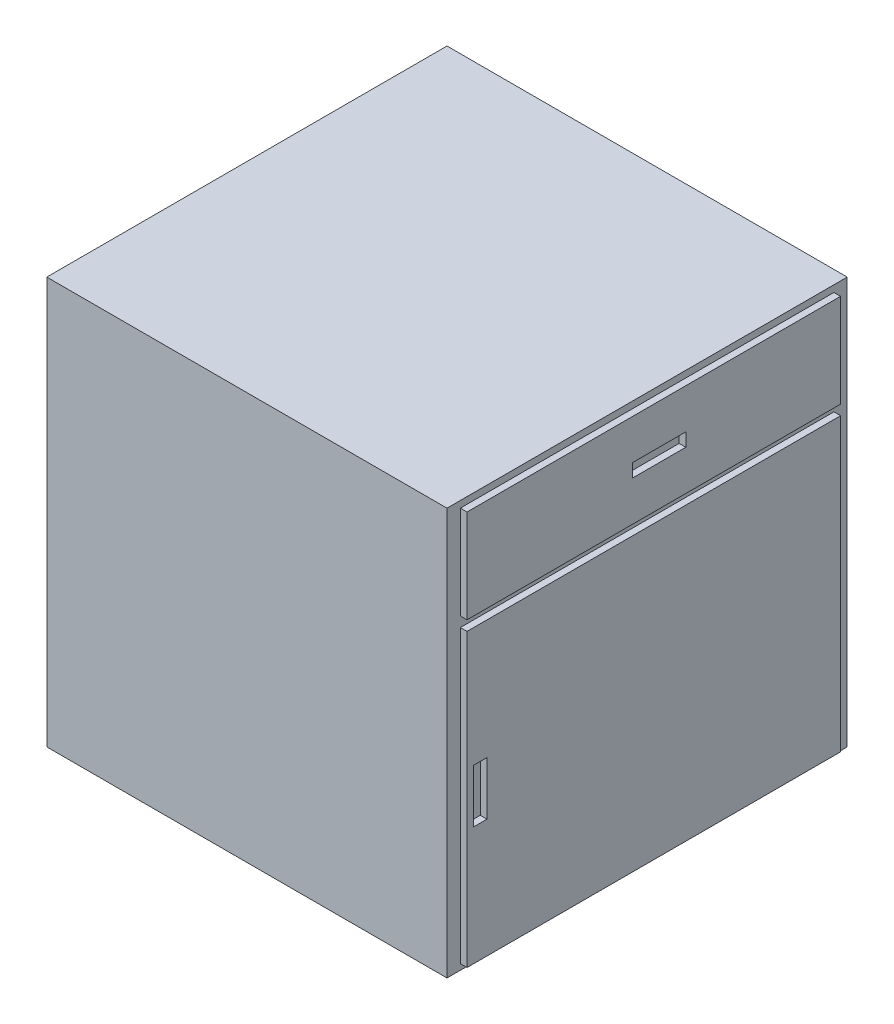
ISO-10303-21;
HEADER;
FILE_DESCRIPTION(('STEP AP214'),'2;1');
FILE_NAME('part.step','',(''),(''),'','','');
FILE_SCHEMA(('AUTOMOTIVE_DESIGN { 1 0 10303 214 1 1 1 1 }'));
ENDSEC;
DATA;
#1=APPLICATION_CONTEXT('core data for automotive mechanical design processes');
#2=APPLICATION_PROTOCOL_DEFINITION('international standard','automotive_design',2000,#1);
#3=PRODUCT_CONTEXT('',#1,'mechanical');
#4=PRODUCT('Part','Part','',(#3));
#5=PRODUCT_RELATED_PRODUCT_CATEGORY('part','',(#4));
#6=PRODUCT_DEFINITION_FORMATION('','',#4);
#7=PRODUCT_DEFINITION_CONTEXT('part definition',#1,'design');
#8=PRODUCT_DEFINITION('design','',#6,#7);
#9=PRODUCT_DEFINITION_SHAPE('','',#8);
#10=(LENGTH_UNIT() NAMED_UNIT(*) SI_UNIT(.MILLI.,.METRE.));
#11=(NAMED_UNIT(*) PLANE_ANGLE_UNIT() SI_UNIT($,.RADIAN.));
#12=(NAMED_UNIT(*) SI_UNIT($,.STERADIAN.) SOLID_ANGLE_UNIT());
#13=UNCERTAINTY_MEASURE_WITH_UNIT(LENGTH_MEASURE(1.E-05),#10,'distance_accuracy_value','');
#14=(GEOMETRIC_REPRESENTATION_CONTEXT(3) GLOBAL_UNCERTAINTY_ASSIGNED_CONTEXT((#13)) GLOBAL_UNIT_ASSIGNED_CONTEXT((#10,
#11,#12)) REPRESENTATION_CONTEXT('',''));
#15=CARTESIAN_POINT('',(0.,0.,0.));
#16=DIRECTION('',(0.,0.,1.));
#17=DIRECTION('',(1.,0.,0.));
#18=AXIS2_PLACEMENT_3D('',#15,#16,#17);
#19=CARTESIAN_POINT('',(0.,0.,600.));
#20=DIRECTION('',(-1.,0.,0.));
#21=DIRECTION('',(0.,-1.,0.));
#22=AXIS2_PLACEMENT_3D('',#19,#20,#21);
#23=PLANE('',#22);
#24=DIRECTION('',(0.,1.,0.));
#25=VECTOR('',#24,1.);
#26=CARTESIAN_POINT('',(0.,0.,0.));
#27=LINE('',#26,#25);
#28=CARTESIAN_POINT('',(0.,-610.,0.));
#29=VERTEX_POINT('',#28);
#30=CARTESIAN_POINT('',(0.,0.,0.));
#31=VERTEX_POINT('',#30);
#32=EDGE_CURVE('E302',#29,#31,#27,.T.);
#33=ORIENTED_EDGE('',*,*,#32,.T.);
#34=DIRECTION('',(0.,0.,-1.));
#35=VECTOR('',#34,1.);
#36=CARTESIAN_POINT('',(0.,0.,600.));
#37=LINE('',#36,#35);
#38=CARTESIAN_POINT('',(0.,0.,600.));
#39=VERTEX_POINT('',#38);
#40=EDGE_CURVE('E11',#39,#31,#37,.T.);
#41=ORIENTED_EDGE('',*,*,#40,.F.);
#42=DIRECTION('',(0.,1.,0.));
#43=VECTOR('',#42,1.);
#44=CARTESIAN_POINT('',(0.,0.,600.));
#45=LINE('',#44,#43);
#46=CARTESIAN_POINT('',(0.,-610.,600.));
#47=VERTEX_POINT('',#46);
#48=EDGE_CURVE('E303',#47,#39,#45,.T.);
#49=ORIENTED_EDGE('',*,*,#48,.F.);
#50=DIRECTION('',(0.,0.,-1.));
#51=VECTOR('',#50,1.);
#52=CARTESIAN_POINT('',(0.,-610.,600.));
#53=LINE('',#52,#51);
#54=EDGE_CURVE('E313',#47,#29,#53,.T.);
#55=ORIENTED_EDGE('',*,*,#54,.T.);
#56=EDGE_LOOP('',(#33,#41,#49,#55));
#57=FACE_BOUND('',#56,.T.);
#58=DIRECTION('',(0.,-1.,0.));
#59=VECTOR('',#58,1.);
#60=CARTESIAN_POINT('',(0.,-9.99660470248492,580.));
#61=LINE('',#60,#59);
#62=CARTESIAN_POINT('',(0.,-9.99660470248492,580.));
#63=VERTEX_POINT('',#62);
#64=CARTESIAN_POINT('',(0.,-149.996604702485,580.));
#65=VERTEX_POINT('',#64);
#66=EDGE_CURVE('E269',#63,#65,#61,.T.);
#67=ORIENTED_EDGE('',*,*,#66,.F.);
#68=DIRECTION('',(0.,0.,1.));
#69=VECTOR('',#68,1.);
#70=CARTESIAN_POINT('',(0.,-9.99660470248492,580.));
#71=LINE('',#70,#69);
#72=CARTESIAN_POINT('',(0.,-9.99660470248492,20.));
#73=VERTEX_POINT('',#72);
#74=EDGE_CURVE('E274',#73,#63,#71,.T.);
#75=ORIENTED_EDGE('',*,*,#74,.F.);
#76=DIRECTION('',(0.,1.,0.));
#77=VECTOR('',#76,1.);
#78=CARTESIAN_POINT('',(0.,-9.99660470248492,20.));
#79=LINE('',#78,#77);
#80=CARTESIAN_POINT('',(0.,-149.996604702485,20.));
#81=VERTEX_POINT('',#80);
#82=EDGE_CURVE('E286',#81,#73,#79,.T.);
#83=ORIENTED_EDGE('',*,*,#82,.F.);
#84=DIRECTION('',(0.,0.,-1.));
#85=VECTOR('',#84,1.);
#86=CARTESIAN_POINT('',(0.,-149.996604702485,580.));
#87=LINE('',#86,#85);
#88=EDGE_CURVE('E283',#65,#81,#87,.T.);
#89=ORIENTED_EDGE('',*,*,#88,.F.);
#90=EDGE_LOOP('',(#67,#75,#83,#89));
#91=FACE_BOUND('',#90,.T.);
#92=DIRECTION('',(0.,-1.,0.));
#93=VECTOR('',#92,1.);
#94=CARTESIAN_POINT('',(0.,-164.996604702485,580.));
#95=LINE('',#94,#93);
#96=CARTESIAN_POINT('',(0.,-164.996604702485,580.));
#97=VERTEX_POINT('',#96);
#98=CARTESIAN_POINT('',(0.,-601.436488002754,580.));
#99=VERTEX_POINT('',#98);
#100=EDGE_CURVE('E188',#97,#99,#95,.T.);
#101=ORIENTED_EDGE('',*,*,#100,.F.);
#102=DIRECTION('',(0.,0.,1.));
#103=VECTOR('',#102,1.);
#104=CARTESIAN_POINT('',(0.,-164.996604702485,580.));
#105=LINE('',#104,#103);
#106=CARTESIAN_POINT('',(0.,-164.996604702485,20.));
#107=VERTEX_POINT('',#106);
#108=EDGE_CURVE('E216',#107,#97,#105,.T.);
#109=ORIENTED_EDGE('',*,*,#108,.F.);
#110=DIRECTION('',(0.,1.,0.));
#111=VECTOR('',#110,1.);
#112=CARTESIAN_POINT('',(0.,-164.996604702485,20.));
#113=LINE('',#112,#111);
#114=CARTESIAN_POINT('',(0.,-601.436488002754,20.));
#115=VERTEX_POINT('',#114);
#116=EDGE_CURVE('E54',#115,#107,#113,.T.);
#117=ORIENTED_EDGE('',*,*,#116,.F.);
#118=DIRECTION('',(0.,0.,-1.));
#119=VECTOR('',#118,1.);
#120=CARTESIAN_POINT('',(0.,-601.436488002754,580.));
#121=LINE('',#120,#119);
#122=EDGE_CURVE('E49',#99,#115,#121,.T.);
#123=ORIENTED_EDGE('',*,*,#122,.F.);
#124=EDGE_LOOP('',(#101,#109,#117,#123));
#125=FACE_BOUND('',#124,.T.);
#126=ADVANCED_FACE('F34',(#57,#91,#125),#23,.F.);
#127=CARTESIAN_POINT('',(0.,0.,600.));
#128=DIRECTION('',(0.,-1.,0.));
#129=DIRECTION('',(1.,0.,0.));
#130=AXIS2_PLACEMENT_3D('',#127,#128,#129);
#131=PLANE('',#130);
#132=DIRECTION('',(-1.,0.,0.));
#133=VECTOR('',#132,1.);
#134=CARTESIAN_POINT('',(0.,0.,0.));
#135=LINE('',#134,#133);
#136=CARTESIAN_POINT('',(-600.,0.,0.));
#137=VERTEX_POINT('',#136);
#138=EDGE_CURVE('E316',#31,#137,#135,.T.);
#139=ORIENTED_EDGE('',*,*,#138,.T.);
#140=DIRECTION('',(0.,0.,-1.));
#141=VECTOR('',#140,1.);
#142=CARTESIAN_POINT('',(-600.,0.,600.));
#143=LINE('',#142,#141);
#144=CARTESIAN_POINT('',(-600.,0.,600.));
#145=VERTEX_POINT('',#144);
#146=EDGE_CURVE('E42',#145,#137,#143,.T.);
#147=ORIENTED_EDGE('',*,*,#146,.F.);
#148=DIRECTION('',(-1.,0.,0.));
#149=VECTOR('',#148,1.);
#150=CARTESIAN_POINT('',(0.,0.,600.));
#151=LINE('',#150,#149);
#152=EDGE_CURVE('E306',#39,#145,#151,.T.);
#153=ORIENTED_EDGE('',*,*,#152,.F.);
#154=ORIENTED_EDGE('',*,*,#40,.T.);
#155=EDGE_LOOP('',(#139,#147,#153,#154));
#156=FACE_BOUND('',#155,.T.);
#157=ADVANCED_FACE('F347',(#156),#131,.F.);
#158=CARTESIAN_POINT('',(-600.,0.,600.));
#159=DIRECTION('',(1.,0.,0.));
#160=DIRECTION('',(0.,0.,-1.));
#161=AXIS2_PLACEMENT_3D('',#158,#159,#160);
#162=PLANE('',#161);
#163=DIRECTION('',(0.,-1.,0.));
#164=VECTOR('',#163,1.);
#165=CARTESIAN_POINT('',(-600.,0.,0.));
#166=LINE('',#165,#164);
#167=CARTESIAN_POINT('',(-600.,-610.,0.));
#168=VERTEX_POINT('',#167);
#169=EDGE_CURVE('E318',#137,#168,#166,.T.);
#170=ORIENTED_EDGE('',*,*,#169,.T.);
#171=DIRECTION('',(0.,0.,-1.));
#172=VECTOR('',#171,1.);
#173=CARTESIAN_POINT('',(-600.,-610.,600.));
#174=LINE('',#173,#172);
#175=CARTESIAN_POINT('',(-600.,-610.,600.));
#176=VERTEX_POINT('',#175);
#177=EDGE_CURVE('E323',#176,#168,#174,.T.);
#178=ORIENTED_EDGE('',*,*,#177,.F.);
#179=DIRECTION('',(0.,-1.,0.));
#180=VECTOR('',#179,1.);
#181=CARTESIAN_POINT('',(-600.,0.,600.));
#182=LINE('',#181,#180);
#183=EDGE_CURVE('E309',#145,#176,#182,.T.);
#184=ORIENTED_EDGE('',*,*,#183,.F.);
#185=ORIENTED_EDGE('',*,*,#146,.T.);
#186=EDGE_LOOP('',(#170,#178,#184,#185));
#187=FACE_BOUND('',#186,.T.);
#188=ADVANCED_FACE('F330',(#187),#162,.F.);
#189=CARTESIAN_POINT('',(0.,-610.,600.));
#190=DIRECTION('',(0.,1.,0.));
#191=DIRECTION('',(-1.,0.,0.));
#192=AXIS2_PLACEMENT_3D('',#189,#190,#191);
#193=PLANE('',#192);
#194=DIRECTION('',(1.,0.,0.));
#195=VECTOR('',#194,1.);
#196=CARTESIAN_POINT('',(0.,-610.,0.));
#197=LINE('',#196,#195);
#198=EDGE_CURVE('E307',#168,#29,#197,.T.);
#199=ORIENTED_EDGE('',*,*,#198,.T.);
#200=ORIENTED_EDGE('',*,*,#54,.F.);
#201=DIRECTION('',(1.,0.,0.));
#202=VECTOR('',#201,1.);
#203=CARTESIAN_POINT('',(0.,-610.,600.));
#204=LINE('',#203,#202);
#205=EDGE_CURVE('E311',#176,#47,#204,.T.);
#206=ORIENTED_EDGE('',*,*,#205,.F.);
#207=ORIENTED_EDGE('',*,*,#177,.T.);
#208=EDGE_LOOP('',(#199,#200,#206,#207));
#209=FACE_BOUND('',#208,.T.);
#210=ADVANCED_FACE('F339',(#209),#193,.F.);
#211=CARTESIAN_POINT('',(0.,0.,600.));
#212=DIRECTION('',(0.,0.,-1.));
#213=DIRECTION('',(-1.,0.,0.));
#214=AXIS2_PLACEMENT_3D('',#211,#212,#213);
#215=PLANE('',#214);
#216=ORIENTED_EDGE('',*,*,#48,.T.);
#217=ORIENTED_EDGE('',*,*,#152,.T.);
#218=ORIENTED_EDGE('',*,*,#183,.T.);
#219=ORIENTED_EDGE('',*,*,#205,.T.);
#220=EDGE_LOOP('',(#216,#217,#218,#219));
#221=FACE_BOUND('',#220,.T.);
#222=ADVANCED_FACE('F346',(#221),#215,.F.);
#223=CARTESIAN_POINT('',(0.,0.,0.));
#224=DIRECTION('',(0.,0.,-1.));
#225=DIRECTION('',(-1.,0.,0.));
#226=AXIS2_PLACEMENT_3D('',#223,#224,#225);
#227=PLANE('',#226);
#228=ORIENTED_EDGE('',*,*,#32,.F.);
#229=ORIENTED_EDGE('',*,*,#198,.F.);
#230=ORIENTED_EDGE('',*,*,#169,.F.);
#231=ORIENTED_EDGE('',*,*,#138,.F.);
#232=EDGE_LOOP('',(#228,#229,#230,#231));
#233=FACE_BOUND('',#232,.T.);
#234=ADVANCED_FACE('F336',(#233),#227,.T.);
#235=CARTESIAN_POINT('',(10.,0.,0.));
#236=DIRECTION('',(1.,0.,0.));
#237=DIRECTION('',(0.,1.,0.));
#238=AXIS2_PLACEMENT_3D('',#235,#236,#237);
#239=PLANE('',#238);
#240=DIRECTION('',(0.,-1.,0.));
#241=VECTOR('',#240,1.);
#242=CARTESIAN_POINT('',(10.,-9.99660470248492,580.));
#243=LINE('',#242,#241);
#244=CARTESIAN_POINT('',(10.,-9.99660470248492,580.));
#245=VERTEX_POINT('',#244);
#246=CARTESIAN_POINT('',(10.,-149.996604702485,580.));
#247=VERTEX_POINT('',#246);
#248=EDGE_CURVE('E270',#245,#247,#243,.T.);
#249=ORIENTED_EDGE('',*,*,#248,.T.);
#250=DIRECTION('',(0.,0.,-1.));
#251=VECTOR('',#250,1.);
#252=CARTESIAN_POINT('',(10.,-149.996604702485,580.));
#253=LINE('',#252,#251);
#254=CARTESIAN_POINT('',(10.,-149.996604702485,20.));
#255=VERTEX_POINT('',#254);
#256=EDGE_CURVE('E273',#247,#255,#253,.T.);
#257=ORIENTED_EDGE('',*,*,#256,.T.);
#258=DIRECTION('',(0.,1.,0.));
#259=VECTOR('',#258,1.);
#260=CARTESIAN_POINT('',(10.,-9.99660470248492,20.));
#261=LINE('',#260,#259);
#262=CARTESIAN_POINT('',(10.,-9.99660470248492,20.));
#263=VERTEX_POINT('',#262);
#264=EDGE_CURVE('E276',#255,#263,#261,.T.);
#265=ORIENTED_EDGE('',*,*,#264,.T.);
#266=DIRECTION('',(0.,0.,1.));
#267=VECTOR('',#266,1.);
#268=CARTESIAN_POINT('',(10.,-9.99660470248492,580.));
#269=LINE('',#268,#267);
#270=EDGE_CURVE('E278',#263,#245,#269,.T.);
#271=ORIENTED_EDGE('',*,*,#270,.T.);
#272=EDGE_LOOP('',(#249,#257,#265,#271));
#273=FACE_BOUND('',#272,.T.);
#274=DIRECTION('',(0.,0.,-1.));
#275=VECTOR('',#274,1.);
#276=CARTESIAN_POINT('',(10.,-89.9605296664098,332.));
#277=LINE('',#276,#275);
#278=CARTESIAN_POINT('',(10.,-89.9605296664098,332.));
#279=VERTEX_POINT('',#278);
#280=CARTESIAN_POINT('',(10.,-89.9605296664098,252.));
#281=VERTEX_POINT('',#280);
#282=EDGE_CURVE('E242',#279,#281,#277,.T.);
#283=ORIENTED_EDGE('',*,*,#282,.F.);
#284=DIRECTION('',(0.,-1.,0.));
#285=VECTOR('',#284,1.);
#286=CARTESIAN_POINT('',(10.,-69.9605296664098,332.));
#287=LINE('',#286,#285);
#288=CARTESIAN_POINT('',(10.,-69.9605296664098,332.));
#289=VERTEX_POINT('',#288);
#290=EDGE_CURVE('E240',#289,#279,#287,.T.);
#291=ORIENTED_EDGE('',*,*,#290,.F.);
#292=DIRECTION('',(0.,0.,1.));
#293=VECTOR('',#292,1.);
#294=CARTESIAN_POINT('',(10.,-69.9605296664098,332.));
#295=LINE('',#294,#293);
#296=CARTESIAN_POINT('',(10.,-69.9605296664098,252.));
#297=VERTEX_POINT('',#296);
#298=EDGE_CURVE('E248',#297,#289,#295,.T.);
#299=ORIENTED_EDGE('',*,*,#298,.F.);
#300=DIRECTION('',(0.,1.,0.));
#301=VECTOR('',#300,1.);
#302=CARTESIAN_POINT('',(10.,-69.9605296664098,252.));
#303=LINE('',#302,#301);
#304=EDGE_CURVE('E245',#281,#297,#303,.T.);
#305=ORIENTED_EDGE('',*,*,#304,.F.);
#306=EDGE_LOOP('',(#283,#291,#299,#305));
#307=FACE_BOUND('',#306,.T.);
#308=ADVANCED_FACE('F360',(#273,#307),#239,.T.);
#309=CARTESIAN_POINT('',(10.,-9.99660470248492,580.));
#310=DIRECTION('',(0.,0.,-1.));
#311=DIRECTION('',(0.,1.,0.));
#312=AXIS2_PLACEMENT_3D('',#309,#310,#311);
#313=PLANE('',#312);
#314=ORIENTED_EDGE('',*,*,#66,.T.);
#315=DIRECTION('',(-1.,0.,0.));
#316=VECTOR('',#315,1.);
#317=CARTESIAN_POINT('',(10.,-149.996604702485,580.));
#318=LINE('',#317,#316);
#319=EDGE_CURVE('E299',#247,#65,#318,.T.);
#320=ORIENTED_EDGE('',*,*,#319,.F.);
#321=ORIENTED_EDGE('',*,*,#248,.F.);
#322=DIRECTION('',(-1.,0.,0.));
#323=VECTOR('',#322,1.);
#324=CARTESIAN_POINT('',(10.,-9.99660470248492,580.));
#325=LINE('',#324,#323);
#326=EDGE_CURVE('E280',#245,#63,#325,.T.);
#327=ORIENTED_EDGE('',*,*,#326,.T.);
#328=EDGE_LOOP('',(#314,#320,#321,#327));
#329=FACE_BOUND('',#328,.T.);
#330=ADVANCED_FACE('F363',(#329),#313,.F.);
#331=CARTESIAN_POINT('',(10.,-149.996604702485,580.));
#332=DIRECTION('',(0.,1.,0.));
#333=DIRECTION('',(-1.,0.,0.));
#334=AXIS2_PLACEMENT_3D('',#331,#332,#333);
#335=PLANE('',#334);
#336=ORIENTED_EDGE('',*,*,#88,.T.);
#337=DIRECTION('',(-1.,0.,0.));
#338=VECTOR('',#337,1.);
#339=CARTESIAN_POINT('',(10.,-149.996604702485,20.));
#340=LINE('',#339,#338);
#341=EDGE_CURVE('E296',#255,#81,#340,.T.);
#342=ORIENTED_EDGE('',*,*,#341,.F.);
#343=ORIENTED_EDGE('',*,*,#256,.F.);
#344=ORIENTED_EDGE('',*,*,#319,.T.);
#345=EDGE_LOOP('',(#336,#342,#343,#344));
#346=FACE_BOUND('',#345,.T.);
#347=ADVANCED_FACE('F366',(#346),#335,.F.);
#348=CARTESIAN_POINT('',(10.,-9.99660470248492,20.));
#349=DIRECTION('',(0.,0.,1.));
#350=DIRECTION('',(1.,0.,0.));
#351=AXIS2_PLACEMENT_3D('',#348,#349,#350);
#352=PLANE('',#351);
#353=ORIENTED_EDGE('',*,*,#82,.T.);
#354=DIRECTION('',(-1.,0.,0.));
#355=VECTOR('',#354,1.);
#356=CARTESIAN_POINT('',(10.,-9.99660470248492,20.));
#357=LINE('',#356,#355);
#358=EDGE_CURVE('E293',#263,#73,#357,.T.);
#359=ORIENTED_EDGE('',*,*,#358,.F.);
#360=ORIENTED_EDGE('',*,*,#264,.F.);
#361=ORIENTED_EDGE('',*,*,#341,.T.);
#362=EDGE_LOOP('',(#353,#359,#360,#361));
#363=FACE_BOUND('',#362,.T.);
#364=ADVANCED_FACE('F370',(#363),#352,.F.);
#365=CARTESIAN_POINT('',(10.,-9.99660470248492,580.));
#366=DIRECTION('',(0.,-1.,0.));
#367=DIRECTION('',(1.,0.,0.));
#368=AXIS2_PLACEMENT_3D('',#365,#366,#367);
#369=PLANE('',#368);
#370=ORIENTED_EDGE('',*,*,#74,.T.);
#371=ORIENTED_EDGE('',*,*,#326,.F.);
#372=ORIENTED_EDGE('',*,*,#270,.F.);
#373=ORIENTED_EDGE('',*,*,#358,.T.);
#374=EDGE_LOOP('',(#370,#371,#372,#373));
#375=FACE_BOUND('',#374,.T.);
#376=ADVANCED_FACE('F374',(#375),#369,.F.);
#377=CARTESIAN_POINT('',(10.,-69.9605296664098,332.));
#378=DIRECTION('',(0.,0.,-1.));
#379=DIRECTION('',(-1.,0.,0.));
#380=AXIS2_PLACEMENT_3D('',#377,#378,#379);
#381=PLANE('',#380);
#382=DIRECTION('',(0.,-1.,0.));
#383=VECTOR('',#382,1.);
#384=CARTESIAN_POINT('',(0.,-69.9605296664098,332.));
#385=LINE('',#384,#383);
#386=CARTESIAN_POINT('',(0.,-69.9605296664098,332.));
#387=VERTEX_POINT('',#386);
#388=CARTESIAN_POINT('',(0.,-89.9605296664098,332.));
#389=VERTEX_POINT('',#388);
#390=EDGE_CURVE('E239',#387,#389,#385,.T.);
#391=ORIENTED_EDGE('',*,*,#390,.F.);
#392=DIRECTION('',(-1.,0.,0.));
#393=VECTOR('',#392,1.);
#394=CARTESIAN_POINT('',(10.,-69.9605296664098,332.));
#395=LINE('',#394,#393);
#396=EDGE_CURVE('E250',#289,#387,#395,.T.);
#397=ORIENTED_EDGE('',*,*,#396,.F.);
#398=ORIENTED_EDGE('',*,*,#290,.T.);
#399=DIRECTION('',(-1.,0.,0.));
#400=VECTOR('',#399,1.);
#401=CARTESIAN_POINT('',(10.,-89.9605296664098,332.));
#402=LINE('',#401,#400);
#403=EDGE_CURVE('E266',#279,#389,#402,.T.);
#404=ORIENTED_EDGE('',*,*,#403,.T.);
#405=EDGE_LOOP('',(#391,#397,#398,#404));
#406=FACE_BOUND('',#405,.T.);
#407=ADVANCED_FACE('F378',(#406),#381,.T.);
#408=CARTESIAN_POINT('',(10.,-89.9605296664098,332.));
#409=DIRECTION('',(0.,1.,0.));
#410=DIRECTION('',(-1.,0.,0.));
#411=AXIS2_PLACEMENT_3D('',#408,#409,#410);
#412=PLANE('',#411);
#413=DIRECTION('',(0.,0.,-1.));
#414=VECTOR('',#413,1.);
#415=CARTESIAN_POINT('',(0.,-89.9605296664098,332.));
#416=LINE('',#415,#414);
#417=CARTESIAN_POINT('',(0.,-89.9605296664098,252.));
#418=VERTEX_POINT('',#417);
#419=EDGE_CURVE('E253',#389,#418,#416,.T.);
#420=ORIENTED_EDGE('',*,*,#419,.F.);
#421=ORIENTED_EDGE('',*,*,#403,.F.);
#422=ORIENTED_EDGE('',*,*,#282,.T.);
#423=DIRECTION('',(-1.,0.,0.));
#424=VECTOR('',#423,1.);
#425=CARTESIAN_POINT('',(10.,-89.9605296664098,252.));
#426=LINE('',#425,#424);
#427=EDGE_CURVE('E264',#281,#418,#426,.T.);
#428=ORIENTED_EDGE('',*,*,#427,.T.);
#429=EDGE_LOOP('',(#420,#421,#422,#428));
#430=FACE_BOUND('',#429,.T.);
#431=ADVANCED_FACE('F385',(#430),#412,.T.);
#432=CARTESIAN_POINT('',(10.,-69.9605296664098,252.));
#433=DIRECTION('',(0.,0.,1.));
#434=DIRECTION('',(1.,0.,0.));
#435=AXIS2_PLACEMENT_3D('',#432,#433,#434);
#436=PLANE('',#435);
#437=DIRECTION('',(0.,1.,0.));
#438=VECTOR('',#437,1.);
#439=CARTESIAN_POINT('',(0.,-69.9605296664098,252.));
#440=LINE('',#439,#438);
#441=CARTESIAN_POINT('',(0.,-69.9605296664098,252.));
#442=VERTEX_POINT('',#441);
#443=EDGE_CURVE('E256',#418,#442,#440,.T.);
#444=ORIENTED_EDGE('',*,*,#443,.F.);
#445=ORIENTED_EDGE('',*,*,#427,.F.);
#446=ORIENTED_EDGE('',*,*,#304,.T.);
#447=DIRECTION('',(-1.,0.,0.));
#448=VECTOR('',#447,1.);
#449=CARTESIAN_POINT('',(10.,-69.9605296664098,252.));
#450=LINE('',#449,#448);
#451=EDGE_CURVE('E262',#297,#442,#450,.T.);
#452=ORIENTED_EDGE('',*,*,#451,.T.);
#453=EDGE_LOOP('',(#444,#445,#446,#452));
#454=FACE_BOUND('',#453,.T.);
#455=ADVANCED_FACE('F389',(#454),#436,.T.);
#456=CARTESIAN_POINT('',(10.,-69.9605296664098,332.));
#457=DIRECTION('',(0.,-1.,0.));
#458=DIRECTION('',(1.,0.,0.));
#459=AXIS2_PLACEMENT_3D('',#456,#457,#458);
#460=PLANE('',#459);
#461=DIRECTION('',(0.,0.,1.));
#462=VECTOR('',#461,1.);
#463=CARTESIAN_POINT('',(0.,-69.9605296664098,332.));
#464=LINE('',#463,#462);
#465=EDGE_CURVE('E243',#442,#387,#464,.T.);
#466=ORIENTED_EDGE('',*,*,#465,.F.);
#467=ORIENTED_EDGE('',*,*,#451,.F.);
#468=ORIENTED_EDGE('',*,*,#298,.T.);
#469=ORIENTED_EDGE('',*,*,#396,.T.);
#470=EDGE_LOOP('',(#466,#467,#468,#469));
#471=FACE_BOUND('',#470,.T.);
#472=ADVANCED_FACE('F393',(#471),#460,.T.);
#473=ORIENTED_EDGE('',*,*,#465,.T.);
#474=ORIENTED_EDGE('',*,*,#390,.T.);
#475=ORIENTED_EDGE('',*,*,#419,.T.);
#476=ORIENTED_EDGE('',*,*,#443,.T.);
#477=EDGE_LOOP('',(#473,#474,#475,#476));
#478=FACE_BOUND('',#477,.T.);
#479=ADVANCED_FACE('F36',(#478),#23,.F.);
#480=CARTESIAN_POINT('',(10.,0.,0.));
#481=DIRECTION('',(1.,0.,0.));
#482=DIRECTION('',(0.,1.,0.));
#483=AXIS2_PLACEMENT_3D('',#480,#481,#482);
#484=PLANE('',#483);
#485=DIRECTION('',(0.,-1.,0.));
#486=VECTOR('',#485,1.);
#487=CARTESIAN_POINT('',(10.,-164.996604702485,580.));
#488=LINE('',#487,#486);
#489=CARTESIAN_POINT('',(10.,-164.996604702485,580.));
#490=VERTEX_POINT('',#489);
#491=CARTESIAN_POINT('',(10.0000000000001,-601.436488002754,580.));
#492=VERTEX_POINT('',#491);
#493=EDGE_CURVE('E212',#490,#492,#488,.T.);
#494=ORIENTED_EDGE('',*,*,#493,.T.);
#495=DIRECTION('',(0.,0.,-1.));
#496=VECTOR('',#495,1.);
#497=CARTESIAN_POINT('',(10.0000000000001,-601.436488002754,580.));
#498=LINE('',#497,#496);
#499=CARTESIAN_POINT('',(10.0000000000001,-601.436488002754,20.));
#500=VERTEX_POINT('',#499);
#501=EDGE_CURVE('E215',#492,#500,#498,.T.);
#502=ORIENTED_EDGE('',*,*,#501,.T.);
#503=DIRECTION('',(0.,1.,0.));
#504=VECTOR('',#503,1.);
#505=CARTESIAN_POINT('',(10.,-164.996604702485,20.));
#506=LINE('',#505,#504);
#507=CARTESIAN_POINT('',(10.,-164.996604702485,20.));
#508=VERTEX_POINT('',#507);
#509=EDGE_CURVE('E218',#500,#508,#506,.T.);
#510=ORIENTED_EDGE('',*,*,#509,.T.);
#511=DIRECTION('',(0.,0.,1.));
#512=VECTOR('',#511,1.);
#513=CARTESIAN_POINT('',(10.,-164.996604702485,580.));
#514=LINE('',#513,#512);
#515=EDGE_CURVE('E220',#508,#490,#514,.T.);
#516=ORIENTED_EDGE('',*,*,#515,.T.);
#517=EDGE_LOOP('',(#494,#502,#510,#516));
#518=FACE_BOUND('',#517,.T.);
#519=DIRECTION('',(0.,0.,-1.));
#520=VECTOR('',#519,1.);
#521=CARTESIAN_POINT('',(10.0000000000001,-423.759018759017,570.));
#522=LINE('',#521,#520);
#523=CARTESIAN_POINT('',(10.0000000000001,-423.759018759017,570.));
#524=VERTEX_POINT('',#523);
#525=CARTESIAN_POINT('',(10.0000000000001,-423.759018759017,550.));
#526=VERTEX_POINT('',#525);
#527=EDGE_CURVE('E180',#524,#526,#522,.T.);
#528=ORIENTED_EDGE('',*,*,#527,.F.);
#529=DIRECTION('',(0.,-1.,0.));
#530=VECTOR('',#529,1.);
#531=CARTESIAN_POINT('',(10.,-343.759018759017,570.));
#532=LINE('',#531,#530);
#533=CARTESIAN_POINT('',(10.,-343.759018759017,570.));
#534=VERTEX_POINT('',#533);
#535=EDGE_CURVE('E170',#534,#524,#532,.T.);
#536=ORIENTED_EDGE('',*,*,#535,.F.);
#537=DIRECTION('',(0.,0.,1.));
#538=VECTOR('',#537,1.);
#539=CARTESIAN_POINT('',(10.,-343.759018759017,570.));
#540=LINE('',#539,#538);
#541=CARTESIAN_POINT('',(10.,-343.759018759017,550.));
#542=VERTEX_POINT('',#541);
#543=EDGE_CURVE('E196',#542,#534,#540,.T.);
#544=ORIENTED_EDGE('',*,*,#543,.F.);
#545=DIRECTION('',(0.,1.,0.));
#546=VECTOR('',#545,1.);
#547=CARTESIAN_POINT('',(10.,-343.759018759017,550.));
#548=LINE('',#547,#546);
#549=EDGE_CURVE('E194',#526,#542,#548,.T.);
#550=ORIENTED_EDGE('',*,*,#549,.F.);
#551=EDGE_LOOP('',(#528,#536,#544,#550));
#552=FACE_BOUND('',#551,.T.);
#553=ADVANCED_FACE('F192',(#518,#552),#484,.T.);
#554=CARTESIAN_POINT('',(10.,-164.996604702485,580.));
#555=DIRECTION('',(0.,0.,-1.));
#556=DIRECTION('',(-1.,0.,0.));
#557=AXIS2_PLACEMENT_3D('',#554,#555,#556);
#558=PLANE('',#557);
#559=ORIENTED_EDGE('',*,*,#100,.T.);
#560=DIRECTION('',(-1.,0.,0.));
#561=VECTOR('',#560,1.);
#562=CARTESIAN_POINT('',(10.0000000000001,-601.436488002754,580.));
#563=LINE('',#562,#561);
#564=EDGE_CURVE('E237',#492,#99,#563,.T.);
#565=ORIENTED_EDGE('',*,*,#564,.F.);
#566=ORIENTED_EDGE('',*,*,#493,.F.);
#567=DIRECTION('',(-1.,0.,0.));
#568=VECTOR('',#567,1.);
#569=CARTESIAN_POINT('',(10.,-164.996604702485,580.));
#570=LINE('',#569,#568);
#571=EDGE_CURVE('E222',#490,#97,#570,.T.);
#572=ORIENTED_EDGE('',*,*,#571,.T.);
#573=EDGE_LOOP('',(#559,#565,#566,#572));
#574=FACE_BOUND('',#573,.T.);
#575=ADVANCED_FACE('F398',(#574),#558,.F.);
#576=CARTESIAN_POINT('',(10.0000000000001,-601.436488002754,580.));
#577=DIRECTION('',(0.,1.,0.));
#578=DIRECTION('',(-1.,0.,0.));
#579=AXIS2_PLACEMENT_3D('',#576,#577,#578);
#580=PLANE('',#579);
#581=ORIENTED_EDGE('',*,*,#122,.T.);
#582=DIRECTION('',(-1.,0.,0.));
#583=VECTOR('',#582,1.);
#584=CARTESIAN_POINT('',(10.0000000000001,-601.436488002754,20.));
#585=LINE('',#584,#583);
#586=EDGE_CURVE('E234',#500,#115,#585,.T.);
#587=ORIENTED_EDGE('',*,*,#586,.F.);
#588=ORIENTED_EDGE('',*,*,#501,.F.);
#589=ORIENTED_EDGE('',*,*,#564,.T.);
#590=EDGE_LOOP('',(#581,#587,#588,#589));
#591=FACE_BOUND('',#590,.T.);
#592=ADVANCED_FACE('F401',(#591),#580,.F.);
#593=CARTESIAN_POINT('',(10.,-164.996604702485,20.));
#594=DIRECTION('',(0.,0.,1.));
#595=DIRECTION('',(1.,0.,0.));
#596=AXIS2_PLACEMENT_3D('',#593,#594,#595);
#597=PLANE('',#596);
#598=ORIENTED_EDGE('',*,*,#116,.T.);
#599=DIRECTION('',(-1.,0.,0.));
#600=VECTOR('',#599,1.);
#601=CARTESIAN_POINT('',(10.,-164.996604702485,20.));
#602=LINE('',#601,#600);
#603=EDGE_CURVE('E231',#508,#107,#602,.T.);
#604=ORIENTED_EDGE('',*,*,#603,.F.);
#605=ORIENTED_EDGE('',*,*,#509,.F.);
#606=ORIENTED_EDGE('',*,*,#586,.T.);
#607=EDGE_LOOP('',(#598,#604,#605,#606));
#608=FACE_BOUND('',#607,.T.);
#609=ADVANCED_FACE('F405',(#608),#597,.F.);
#610=CARTESIAN_POINT('',(10.,-164.996604702485,580.));
#611=DIRECTION('',(0.,-1.,0.));
#612=DIRECTION('',(1.,0.,0.));
#613=AXIS2_PLACEMENT_3D('',#610,#611,#612);
#614=PLANE('',#613);
#615=ORIENTED_EDGE('',*,*,#108,.T.);
#616=ORIENTED_EDGE('',*,*,#571,.F.);
#617=ORIENTED_EDGE('',*,*,#515,.F.);
#618=ORIENTED_EDGE('',*,*,#603,.T.);
#619=EDGE_LOOP('',(#615,#616,#617,#618));
#620=FACE_BOUND('',#619,.T.);
#621=ADVANCED_FACE('F409',(#620),#614,.F.);
#622=CARTESIAN_POINT('',(10.,-343.759018759017,570.));
#623=DIRECTION('',(0.,0.,-1.));
#624=DIRECTION('',(-1.,0.,0.));
#625=AXIS2_PLACEMENT_3D('',#622,#623,#624);
#626=PLANE('',#625);
#627=DIRECTION('',(0.,-1.,0.));
#628=VECTOR('',#627,1.);
#629=CARTESIAN_POINT('',(0.,-343.759018759017,570.));
#630=LINE('',#629,#628);
#631=CARTESIAN_POINT('',(0.,-343.759018759017,570.));
#632=VERTEX_POINT('',#631);
#633=CARTESIAN_POINT('',(0.,-423.759018759017,570.));
#634=VERTEX_POINT('',#633);
#635=EDGE_CURVE('E200',#632,#634,#630,.T.);
#636=ORIENTED_EDGE('',*,*,#635,.F.);
#637=DIRECTION('',(-1.,0.,0.));
#638=VECTOR('',#637,1.);
#639=CARTESIAN_POINT('',(10.,-343.759018759017,570.));
#640=LINE('',#639,#638);
#641=EDGE_CURVE('E176',#534,#632,#640,.T.);
#642=ORIENTED_EDGE('',*,*,#641,.F.);
#643=ORIENTED_EDGE('',*,*,#535,.T.);
#644=DIRECTION('',(-1.,0.,0.));
#645=VECTOR('',#644,1.);
#646=CARTESIAN_POINT('',(10.0000000000001,-423.759018759017,570.));
#647=LINE('',#646,#645);
#648=EDGE_CURVE('E174',#524,#634,#647,.T.);
#649=ORIENTED_EDGE('',*,*,#648,.T.);
#650=EDGE_LOOP('',(#636,#642,#643,#649));
#651=FACE_BOUND('',#650,.T.);
#652=ADVANCED_FACE('F173',(#651),#626,.T.);
#653=CARTESIAN_POINT('',(10.0000000000001,-423.759018759017,570.));
#654=DIRECTION('',(0.,1.,0.));
#655=DIRECTION('',(-1.,0.,0.));
#656=AXIS2_PLACEMENT_3D('',#653,#654,#655);
#657=PLANE('',#656);
#658=DIRECTION('',(0.,0.,-1.));
#659=VECTOR('',#658,1.);
#660=CARTESIAN_POINT('',(0.,-423.759018759017,570.));
#661=LINE('',#660,#659);
#662=CARTESIAN_POINT('',(0.,-423.759018759017,550.));
#663=VERTEX_POINT('',#662);
#664=EDGE_CURVE('E187',#634,#663,#661,.T.);
#665=ORIENTED_EDGE('',*,*,#664,.F.);
#666=ORIENTED_EDGE('',*,*,#648,.F.);
#667=ORIENTED_EDGE('',*,*,#527,.T.);
#668=DIRECTION('',(-1.,0.,0.));
#669=VECTOR('',#668,1.);
#670=CARTESIAN_POINT('',(10.0000000000001,-423.759018759017,550.));
#671=LINE('',#670,#669);
#672=EDGE_CURVE('E189',#526,#663,#671,.T.);
#673=ORIENTED_EDGE('',*,*,#672,.T.);
#674=EDGE_LOOP('',(#665,#666,#667,#673));
#675=FACE_BOUND('',#674,.T.);
#676=ADVANCED_FACE('F184',(#675),#657,.T.);
#677=CARTESIAN_POINT('',(10.,-343.759018759017,550.));
#678=DIRECTION('',(0.,0.,1.));
#679=DIRECTION('',(0.,-1.,0.));
#680=AXIS2_PLACEMENT_3D('',#677,#678,#679);
#681=PLANE('',#680);
#682=DIRECTION('',(0.,1.,0.));
#683=VECTOR('',#682,1.);
#684=CARTESIAN_POINT('',(0.,-343.759018759017,550.));
#685=LINE('',#684,#683);
#686=CARTESIAN_POINT('',(0.,-343.759018759017,550.));
#687=VERTEX_POINT('',#686);
#688=EDGE_CURVE('E203',#663,#687,#685,.T.);
#689=ORIENTED_EDGE('',*,*,#688,.F.);
#690=ORIENTED_EDGE('',*,*,#672,.F.);
#691=ORIENTED_EDGE('',*,*,#549,.T.);
#692=DIRECTION('',(-1.,0.,0.));
#693=VECTOR('',#692,1.);
#694=CARTESIAN_POINT('',(10.,-343.759018759017,550.));
#695=LINE('',#694,#693);
#696=EDGE_CURVE('E209',#542,#687,#695,.T.);
#697=ORIENTED_EDGE('',*,*,#696,.T.);
#698=EDGE_LOOP('',(#689,#690,#691,#697));
#699=FACE_BOUND('',#698,.T.);
#700=ADVANCED_FACE('F421',(#699),#681,.T.);
#701=CARTESIAN_POINT('',(10.,-343.759018759017,570.));
#702=DIRECTION('',(0.,-1.,0.));
#703=DIRECTION('',(0.,0.,-1.));
#704=AXIS2_PLACEMENT_3D('',#701,#702,#703);
#705=PLANE('',#704);
#706=DIRECTION('',(0.,0.,1.));
#707=VECTOR('',#706,1.);
#708=CARTESIAN_POINT('',(0.,-343.759018759017,570.));
#709=LINE('',#708,#707);
#710=EDGE_CURVE('E181',#687,#632,#709,.T.);
#711=ORIENTED_EDGE('',*,*,#710,.F.);
#712=ORIENTED_EDGE('',*,*,#696,.F.);
#713=ORIENTED_EDGE('',*,*,#543,.T.);
#714=ORIENTED_EDGE('',*,*,#641,.T.);
#715=EDGE_LOOP('',(#711,#712,#713,#714));
#716=FACE_BOUND('',#715,.T.);
#717=ADVANCED_FACE('F424',(#716),#705,.T.);
#718=ORIENTED_EDGE('',*,*,#710,.T.);
#719=ORIENTED_EDGE('',*,*,#635,.T.);
#720=ORIENTED_EDGE('',*,*,#664,.T.);
#721=ORIENTED_EDGE('',*,*,#688,.T.);
#722=EDGE_LOOP('',(#718,#719,#720,#721));
#723=FACE_BOUND('',#722,.T.);
#724=ADVANCED_FACE('F354',(#723),#23,.F.);
#725=CLOSED_SHELL('',(#126,#157,#188,#210,#222,#234,#308,#330,#347,#364,#376,#407,#431,#455,
#472,#479,#553,#575,#592,#609,#621,#652,#676,#700,#717,#724));
#726=MANIFOLD_SOLID_BREP('B2',#725);
#727=ADVANCED_BREP_SHAPE_REPRESENTATION('',(#18,#726),#14);
#728=SHAPE_DEFINITION_REPRESENTATION(#9,#727);
ENDSEC;
END-ISO-10303-21;
